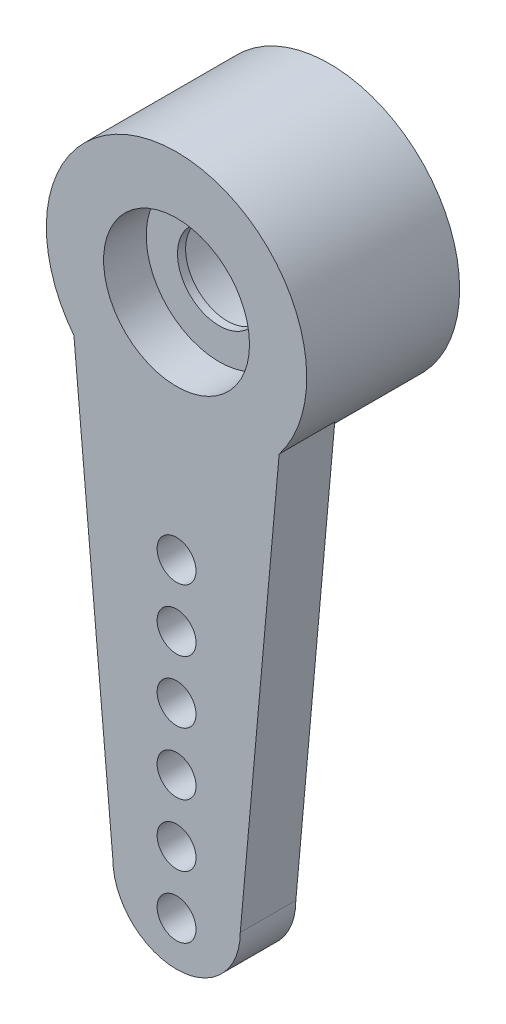
ISO-10303-21;
HEADER;
FILE_DESCRIPTION(('STEP AP214'),'2;1');
FILE_NAME('part.step','',(''),(''),'','','');
FILE_SCHEMA(('AUTOMOTIVE_DESIGN { 1 0 10303 214 1 1 1 1 }'));
ENDSEC;
DATA;
#1=APPLICATION_CONTEXT('core data for automotive mechanical design processes');
#2=APPLICATION_PROTOCOL_DEFINITION('international standard','automotive_design',2000,#1);
#3=PRODUCT_CONTEXT('',#1,'mechanical');
#4=PRODUCT('Part','Part','',(#3));
#5=PRODUCT_RELATED_PRODUCT_CATEGORY('part','',(#4));
#6=PRODUCT_DEFINITION_FORMATION('','',#4);
#7=PRODUCT_DEFINITION_CONTEXT('part definition',#1,'design');
#8=PRODUCT_DEFINITION('design','',#6,#7);
#9=PRODUCT_DEFINITION_SHAPE('','',#8);
#10=(LENGTH_UNIT() NAMED_UNIT(*) SI_UNIT(.MILLI.,.METRE.));
#11=(NAMED_UNIT(*) PLANE_ANGLE_UNIT() SI_UNIT($,.RADIAN.));
#12=(NAMED_UNIT(*) SI_UNIT($,.STERADIAN.) SOLID_ANGLE_UNIT());
#13=UNCERTAINTY_MEASURE_WITH_UNIT(LENGTH_MEASURE(1.E-05),#10,'distance_accuracy_value','');
#14=(GEOMETRIC_REPRESENTATION_CONTEXT(3) GLOBAL_UNCERTAINTY_ASSIGNED_CONTEXT((#13)) GLOBAL_UNIT_ASSIGNED_CONTEXT((#10,
#11,#12)) REPRESENTATION_CONTEXT('',''));
#15=CARTESIAN_POINT('',(0.,0.,0.));
#16=DIRECTION('',(0.,0.,1.));
#17=DIRECTION('',(1.,0.,0.));
#18=AXIS2_PLACEMENT_3D('',#15,#16,#17);
#19=CARTESIAN_POINT('',(-5.49999999999997,0.,-2.84196586235089));
#20=DIRECTION('',(0.,0.,-1.));
#21=DIRECTION('',(-1.,0.,0.));
#22=AXIS2_PLACEMENT_3D('',#19,#20,#21);
#23=CYLINDRICAL_SURFACE('',#22,2.);
#24=CARTESIAN_POINT('',(-5.49999999999997,0.,-7.03296586235089));
#25=DIRECTION('',(0.,0.,1.));
#26=DIRECTION('',(1.,0.,0.));
#27=AXIS2_PLACEMENT_3D('',#24,#25,#26);
#28=CIRCLE('',#27,2.);
#29=CARTESIAN_POINT('',(-3.49999999999996,0.,-7.03296586235089));
#30=VERTEX_POINT('',#29);
#31=EDGE_CURVE('E118',#30,#30,#28,.T.);
#32=ORIENTED_EDGE('',*,*,#31,.F.);
#33=EDGE_LOOP('',(#32));
#34=FACE_BOUND('',#33,.T.);
#35=CARTESIAN_POINT('',(-5.49999999999997,0.,-4.23296586235089));
#36=DIRECTION('',(0.,0.,1.));
#37=DIRECTION('',(1.,0.,0.));
#38=AXIS2_PLACEMENT_3D('',#35,#36,#37);
#39=CIRCLE('',#38,2.00000000000001);
#40=CARTESIAN_POINT('',(-3.49999999999996,0.,-4.23296586235089));
#41=VERTEX_POINT('',#40);
#42=EDGE_CURVE('E114',#41,#41,#39,.T.);
#43=ORIENTED_EDGE('',*,*,#42,.T.);
#44=EDGE_LOOP('',(#43));
#45=FACE_BOUND('',#44,.T.);
#46=ADVANCED_FACE('F41',(#34,#45),#23,.F.);
#47=CARTESIAN_POINT('',(-5.49999999999997,0.,-2.84196586235089));
#48=DIRECTION('',(0.,0.,1.));
#49=DIRECTION('',(1.,0.,0.));
#50=AXIS2_PLACEMENT_3D('',#47,#48,#49);
#51=PLANE('',#50);
#52=CARTESIAN_POINT('',(-5.49999999999997,0.,-2.84196586235089));
#53=DIRECTION('',(0.,0.,1.));
#54=DIRECTION('',(1.,0.,0.));
#55=AXIS2_PLACEMENT_3D('',#52,#53,#54);
#56=CIRCLE('',#55,3.5687);
#57=CARTESIAN_POINT('',(-2.68694999999995,-2.19598938692788,-2.84196586235089));
#58=VERTEX_POINT('',#57);
#59=CARTESIAN_POINT('',(-8.31304999999995,-2.1959893869279,-2.84196586235089));
#60=VERTEX_POINT('',#59);
#61=EDGE_CURVE('E49',#58,#60,#56,.T.);
#62=ORIENTED_EDGE('',*,*,#61,.T.);
#63=DIRECTION('',(0.0893287482023586,-0.996002196154506,0.));
#64=VECTOR('',#63,1.);
#65=CARTESIAN_POINT('',(-7.24624999999995,-14.09065,-2.84196586235089));
#66=LINE('',#65,#64);
#67=CARTESIAN_POINT('',(-7.24624999999995,-14.09065,-2.84196586235089));
#68=VERTEX_POINT('',#67);
#69=EDGE_CURVE('E202',#60,#68,#66,.T.);
#70=ORIENTED_EDGE('',*,*,#69,.T.);
#71=CARTESIAN_POINT('',(-5.49999999999995,-14.09065,-2.84196586235089));
#72=DIRECTION('',(0.,0.,1.));
#73=DIRECTION('',(1.,0.,0.));
#74=AXIS2_PLACEMENT_3D('',#71,#72,#73);
#75=CIRCLE('',#74,1.74625);
#76=CARTESIAN_POINT('',(-3.75374999999995,-14.09065,-2.84196586235089));
#77=VERTEX_POINT('',#76);
#78=EDGE_CURVE('E196',#68,#77,#75,.T.);
#79=ORIENTED_EDGE('',*,*,#78,.T.);
#80=DIRECTION('',(0.0893287482023584,0.996002196154506,0.));
#81=VECTOR('',#80,1.);
#82=CARTESIAN_POINT('',(-3.75374999999995,-14.09065,-2.84196586235089));
#83=LINE('',#82,#81);
#84=EDGE_CURVE('E56',#77,#58,#83,.T.);
#85=ORIENTED_EDGE('',*,*,#84,.T.);
#86=EDGE_LOOP('',(#62,#70,#79,#85));
#87=FACE_BOUND('',#86,.T.);
#88=CARTESIAN_POINT('',(-5.49999999999997,0.,-2.84196586235089));
#89=DIRECTION('',(0.,0.,1.));
#90=DIRECTION('',(1.,0.,0.));
#91=AXIS2_PLACEMENT_3D('',#88,#89,#90);
#92=CIRCLE('',#91,2.);
#93=CARTESIAN_POINT('',(-3.49999999999996,0.,-2.84196586235089));
#94=VERTEX_POINT('',#93);
#95=EDGE_CURVE('E121',#94,#94,#92,.T.);
#96=ORIENTED_EDGE('',*,*,#95,.F.);
#97=EDGE_LOOP('',(#96));
#98=FACE_BOUND('',#97,.T.);
#99=CARTESIAN_POINT('',(-5.49999999999997,-6.11505,-2.84196586235089));
#100=DIRECTION('',(0.,0.,1.));
#101=DIRECTION('',(1.,0.,0.));
#102=AXIS2_PLACEMENT_3D('',#99,#100,#101);
#103=CIRCLE('',#102,0.533399999999999);
#104=CARTESIAN_POINT('',(-4.96659999999997,-6.11505,-2.84196586235089));
#105=VERTEX_POINT('',#104);
#106=EDGE_CURVE('E171',#105,#105,#103,.T.);
#107=ORIENTED_EDGE('',*,*,#106,.F.);
#108=EDGE_LOOP('',(#107));
#109=FACE_BOUND('',#108,.T.);
#110=CARTESIAN_POINT('',(-5.49999999999997,-7.81685,-2.84196586235089));
#111=DIRECTION('',(0.,0.,1.));
#112=DIRECTION('',(1.,0.,0.));
#113=AXIS2_PLACEMENT_3D('',#110,#111,#112);
#114=CIRCLE('',#113,0.533399999999999);
#115=CARTESIAN_POINT('',(-4.96659999999997,-7.81685,-2.84196586235089));
#116=VERTEX_POINT('',#115);
#117=EDGE_CURVE('E175',#116,#116,#114,.T.);
#118=ORIENTED_EDGE('',*,*,#117,.F.);
#119=EDGE_LOOP('',(#118));
#120=FACE_BOUND('',#119,.T.);
#121=CARTESIAN_POINT('',(-5.49999999999997,-9.51865,-2.84196586235089));
#122=DIRECTION('',(0.,0.,1.));
#123=DIRECTION('',(1.,0.,0.));
#124=AXIS2_PLACEMENT_3D('',#121,#122,#123);
#125=CIRCLE('',#124,0.5334);
#126=CARTESIAN_POINT('',(-4.96659999999997,-9.51865,-2.84196586235089));
#127=VERTEX_POINT('',#126);
#128=EDGE_CURVE('E179',#127,#127,#125,.T.);
#129=ORIENTED_EDGE('',*,*,#128,.F.);
#130=EDGE_LOOP('',(#129));
#131=FACE_BOUND('',#130,.T.);
#132=CARTESIAN_POINT('',(-5.49999999999997,-11.22045,-2.84196586235089));
#133=DIRECTION('',(0.,0.,1.));
#134=DIRECTION('',(1.,0.,0.));
#135=AXIS2_PLACEMENT_3D('',#132,#133,#134);
#136=CIRCLE('',#135,0.5334);
#137=CARTESIAN_POINT('',(-4.96659999999997,-11.22045,-2.84196586235089));
#138=VERTEX_POINT('',#137);
#139=EDGE_CURVE('E183',#138,#138,#136,.T.);
#140=ORIENTED_EDGE('',*,*,#139,.F.);
#141=EDGE_LOOP('',(#140));
#142=FACE_BOUND('',#141,.T.);
#143=CARTESIAN_POINT('',(-5.49999999999997,-12.92225,-2.84196586235089));
#144=DIRECTION('',(0.,0.,1.));
#145=DIRECTION('',(1.,0.,0.));
#146=AXIS2_PLACEMENT_3D('',#143,#144,#145);
#147=CIRCLE('',#146,0.5334);
#148=CARTESIAN_POINT('',(-4.96659999999997,-12.92225,-2.84196586235089));
#149=VERTEX_POINT('',#148);
#150=EDGE_CURVE('E187',#149,#149,#147,.T.);
#151=ORIENTED_EDGE('',*,*,#150,.F.);
#152=EDGE_LOOP('',(#151));
#153=FACE_BOUND('',#152,.T.);
#154=CARTESIAN_POINT('',(-5.49999999999995,-14.62405,-2.84196586235089));
#155=DIRECTION('',(0.,0.,1.));
#156=DIRECTION('',(1.,0.,0.));
#157=AXIS2_PLACEMENT_3D('',#154,#155,#156);
#158=CIRCLE('',#157,0.5334);
#159=CARTESIAN_POINT('',(-4.96659999999995,-14.62405,-2.84196586235089));
#160=VERTEX_POINT('',#159);
#161=EDGE_CURVE('E190',#160,#160,#158,.T.);
#162=ORIENTED_EDGE('',*,*,#161,.F.);
#163=EDGE_LOOP('',(#162));
#164=FACE_BOUND('',#163,.T.);
#165=ADVANCED_FACE('F133',(#87,#98,#109,#120,#131,#142,#153,#164),#51,.T.);
#166=CARTESIAN_POINT('',(-5.49999999999997,0.,-7.03296586235089));
#167=DIRECTION('',(0.,0.,1.));
#168=DIRECTION('',(1.,0.,0.));
#169=AXIS2_PLACEMENT_3D('',#166,#167,#168);
#170=PLANE('',#169);
#171=CARTESIAN_POINT('',(-5.49999999999997,0.,-7.03296586235089));
#172=DIRECTION('',(0.,0.,1.));
#173=DIRECTION('',(1.,0.,0.));
#174=AXIS2_PLACEMENT_3D('',#171,#172,#173);
#175=CIRCLE('',#174,3.5687);
#176=CARTESIAN_POINT('',(-1.93129999999997,0.,-7.03296586235089));
#177=VERTEX_POINT('',#176);
#178=EDGE_CURVE('E124',#177,#177,#175,.T.);
#179=ORIENTED_EDGE('',*,*,#178,.F.);
#180=EDGE_LOOP('',(#179));
#181=FACE_BOUND('',#180,.T.);
#182=ORIENTED_EDGE('',*,*,#31,.T.);
#183=EDGE_LOOP('',(#182));
#184=FACE_BOUND('',#183,.T.);
#185=ADVANCED_FACE('F130',(#181,#184),#170,.F.);
#186=CARTESIAN_POINT('',(-5.49999999999997,0.,-2.84196586235089));
#187=DIRECTION('',(0.,0.,-1.));
#188=DIRECTION('',(-1.,0.,0.));
#189=AXIS2_PLACEMENT_3D('',#186,#187,#188);
#190=CYLINDRICAL_SURFACE('',#189,3.5687);
#191=CARTESIAN_POINT('',(-5.49999999999995,0.,-4.36596586235089));
#192=DIRECTION('',(0.,0.,-1.));
#193=DIRECTION('',(-1.,0.,0.));
#194=AXIS2_PLACEMENT_3D('',#191,#192,#193);
#195=CIRCLE('',#194,3.5687);
#196=CARTESIAN_POINT('',(-2.68694999999995,-2.1959893869279,-4.36596586235089));
#197=VERTEX_POINT('',#196);
#198=CARTESIAN_POINT('',(-8.31304999999995,-2.1959893869279,-4.36596586235089));
#199=VERTEX_POINT('',#198);
#200=EDGE_CURVE('E91',#197,#199,#195,.T.);
#201=ORIENTED_EDGE('',*,*,#200,.T.);
#202=DIRECTION('',(0.,0.,1.));
#203=VECTOR('',#202,1.);
#204=CARTESIAN_POINT('',(-8.31304999999995,-2.1959893869279,-4.36596586235089));
#205=LINE('',#204,#203);
#206=EDGE_CURVE('E105',#199,#60,#205,.T.);
#207=ORIENTED_EDGE('',*,*,#206,.T.);
#208=ORIENTED_EDGE('',*,*,#61,.F.);
#209=DIRECTION('',(0.,0.,1.));
#210=VECTOR('',#209,1.);
#211=CARTESIAN_POINT('',(-2.68694999999995,-2.1959893869279,-4.36596586235089));
#212=LINE('',#211,#210);
#213=EDGE_CURVE('E100',#197,#58,#212,.T.);
#214=ORIENTED_EDGE('',*,*,#213,.F.);
#215=EDGE_LOOP('',(#201,#207,#208,#214));
#216=FACE_BOUND('',#215,.T.);
#217=ORIENTED_EDGE('',*,*,#178,.T.);
#218=EDGE_LOOP('',(#217));
#219=FACE_BOUND('',#218,.T.);
#220=ADVANCED_FACE('F43',(#216,#219),#190,.T.);
#221=CARTESIAN_POINT('',(-5.49999999999997,0.,-4.01036586235089));
#222=DIRECTION('',(0.,0.,1.));
#223=DIRECTION('',(1.,0.,0.));
#224=AXIS2_PLACEMENT_3D('',#221,#222,#223);
#225=CIRCLE('',#224,2.);
#226=CARTESIAN_POINT('',(-3.49999999999996,0.,-4.01036586235089));
#227=VERTEX_POINT('',#226);
#228=EDGE_CURVE('E12',#227,#227,#225,.T.);
#229=ORIENTED_EDGE('',*,*,#228,.F.);
#230=EDGE_LOOP('',(#229));
#231=FACE_BOUND('',#230,.T.);
#232=ORIENTED_EDGE('',*,*,#95,.T.);
#233=EDGE_LOOP('',(#232));
#234=FACE_BOUND('',#233,.T.);
#235=ADVANCED_FACE('F139',(#231,#234),#23,.F.);
#236=CARTESIAN_POINT('',(-5.49999999999997,0.,-4.23296586235089));
#237=DIRECTION('',(0.,0.,1.));
#238=DIRECTION('',(1.,0.,0.));
#239=AXIS2_PLACEMENT_3D('',#236,#237,#238);
#240=PLANE('',#239);
#241=ORIENTED_EDGE('',*,*,#42,.F.);
#242=EDGE_LOOP('',(#241));
#243=FACE_BOUND('',#242,.T.);
#244=CARTESIAN_POINT('',(-5.49999999999997,0.,-4.23296586235089));
#245=DIRECTION('',(0.,0.,1.));
#246=DIRECTION('',(1.,0.,0.));
#247=AXIS2_PLACEMENT_3D('',#244,#245,#246);
#248=CIRCLE('',#247,1.14300000000001);
#249=CARTESIAN_POINT('',(-4.35699999999996,0.,-4.23296586235089));
#250=VERTEX_POINT('',#249);
#251=EDGE_CURVE('E111',#250,#250,#248,.T.);
#252=ORIENTED_EDGE('',*,*,#251,.T.);
#253=EDGE_LOOP('',(#252));
#254=FACE_BOUND('',#253,.T.);
#255=ADVANCED_FACE('F142',(#243,#254),#240,.F.);
#256=CARTESIAN_POINT('',(-5.49999999999997,0.,2.81488838714151));
#257=DIRECTION('',(0.,0.,-1.));
#258=DIRECTION('',(-1.,0.,0.));
#259=AXIS2_PLACEMENT_3D('',#256,#257,#258);
#260=CYLINDRICAL_SURFACE('',#259,1.14300000000001);
#261=ORIENTED_EDGE('',*,*,#251,.F.);
#262=EDGE_LOOP('',(#261));
#263=FACE_BOUND('',#262,.T.);
#264=CARTESIAN_POINT('',(-5.49999999999997,0.,-4.01036586235089));
#265=DIRECTION('',(0.,0.,1.));
#266=DIRECTION('',(1.,0.,0.));
#267=AXIS2_PLACEMENT_3D('',#264,#265,#266);
#268=CIRCLE('',#267,1.14300000000001);
#269=CARTESIAN_POINT('',(-4.35699999999996,0.,-4.01036586235089));
#270=VERTEX_POINT('',#269);
#271=EDGE_CURVE('E115',#270,#270,#268,.T.);
#272=ORIENTED_EDGE('',*,*,#271,.T.);
#273=EDGE_LOOP('',(#272));
#274=FACE_BOUND('',#273,.T.);
#275=ADVANCED_FACE('F145',(#263,#274),#260,.F.);
#276=CARTESIAN_POINT('',(-5.49999999999997,0.,-4.01036586235089));
#277=DIRECTION('',(0.,0.,1.));
#278=DIRECTION('',(1.,0.,0.));
#279=AXIS2_PLACEMENT_3D('',#276,#277,#278);
#280=PLANE('',#279);
#281=ORIENTED_EDGE('',*,*,#271,.F.);
#282=EDGE_LOOP('',(#281));
#283=FACE_BOUND('',#282,.T.);
#284=ORIENTED_EDGE('',*,*,#228,.T.);
#285=EDGE_LOOP('',(#284));
#286=FACE_BOUND('',#285,.T.);
#287=ADVANCED_FACE('F151',(#283,#286),#280,.T.);
#288=CARTESIAN_POINT('',(-5.49999999999995,-14.09065,-4.36596586235089));
#289=DIRECTION('',(0.,0.,1.));
#290=DIRECTION('',(1.,0.,0.));
#291=AXIS2_PLACEMENT_3D('',#288,#289,#290);
#292=CYLINDRICAL_SURFACE('',#291,1.74625);
#293=ORIENTED_EDGE('',*,*,#78,.F.);
#294=DIRECTION('',(0.,0.,1.));
#295=VECTOR('',#294,1.);
#296=CARTESIAN_POINT('',(-7.24624999999995,-14.09065,-4.36596586235089));
#297=LINE('',#296,#295);
#298=CARTESIAN_POINT('',(-7.24624999999995,-14.09065,-4.36596586235089));
#299=VERTEX_POINT('',#298);
#300=EDGE_CURVE('E65',#299,#68,#297,.T.);
#301=ORIENTED_EDGE('',*,*,#300,.F.);
#302=CARTESIAN_POINT('',(-5.49999999999995,-14.09065,-4.36596586235089));
#303=DIRECTION('',(0.,0.,1.));
#304=DIRECTION('',(1.,0.,0.));
#305=AXIS2_PLACEMENT_3D('',#302,#303,#304);
#306=CIRCLE('',#305,1.74625);
#307=CARTESIAN_POINT('',(-3.75374999999995,-14.09065,-4.36596586235089));
#308=VERTEX_POINT('',#307);
#309=EDGE_CURVE('E102',#299,#308,#306,.T.);
#310=ORIENTED_EDGE('',*,*,#309,.T.);
#311=DIRECTION('',(0.,0.,1.));
#312=VECTOR('',#311,1.);
#313=CARTESIAN_POINT('',(-3.75374999999995,-14.09065,-4.36596586235089));
#314=LINE('',#313,#312);
#315=EDGE_CURVE('E85',#308,#77,#314,.T.);
#316=ORIENTED_EDGE('',*,*,#315,.T.);
#317=EDGE_LOOP('',(#293,#301,#310,#316));
#318=FACE_BOUND('',#317,.T.);
#319=ADVANCED_FACE('F157',(#318),#292,.T.);
#320=CARTESIAN_POINT('',(-7.24624999999995,-14.09065,-4.36596586235089));
#321=DIRECTION('',(-0.996002196154506,-0.0893287482023586,0.));
#322=DIRECTION('',(0.0893287482023586,-0.996002196154506,0.));
#323=AXIS2_PLACEMENT_3D('',#320,#321,#322);
#324=PLANE('',#323);
#325=ORIENTED_EDGE('',*,*,#69,.F.);
#326=ORIENTED_EDGE('',*,*,#206,.F.);
#327=DIRECTION('',(0.0893287482023586,-0.996002196154506,0.));
#328=VECTOR('',#327,1.);
#329=CARTESIAN_POINT('',(-7.24624999999995,-14.09065,-4.36596586235089));
#330=LINE('',#329,#328);
#331=EDGE_CURVE('E94',#199,#299,#330,.T.);
#332=ORIENTED_EDGE('',*,*,#331,.T.);
#333=ORIENTED_EDGE('',*,*,#300,.T.);
#334=EDGE_LOOP('',(#325,#326,#332,#333));
#335=FACE_BOUND('',#334,.T.);
#336=ADVANCED_FACE('F208',(#335),#324,.T.);
#337=CARTESIAN_POINT('',(-3.75374999999995,-14.09065,-4.36596586235089));
#338=DIRECTION('',(0.996002196154506,-0.0893287482023584,0.));
#339=DIRECTION('',(0.0893287482023584,0.996002196154506,0.));
#340=AXIS2_PLACEMENT_3D('',#337,#338,#339);
#341=PLANE('',#340);
#342=ORIENTED_EDGE('',*,*,#84,.F.);
#343=ORIENTED_EDGE('',*,*,#315,.F.);
#344=DIRECTION('',(0.0893287482023584,0.996002196154506,0.));
#345=VECTOR('',#344,1.);
#346=CARTESIAN_POINT('',(-3.75374999999995,-14.09065,-4.36596586235089));
#347=LINE('',#346,#345);
#348=EDGE_CURVE('E93',#308,#197,#347,.T.);
#349=ORIENTED_EDGE('',*,*,#348,.T.);
#350=ORIENTED_EDGE('',*,*,#213,.T.);
#351=EDGE_LOOP('',(#342,#343,#349,#350));
#352=FACE_BOUND('',#351,.T.);
#353=ADVANCED_FACE('F99',(#352),#341,.T.);
#354=CARTESIAN_POINT('',(-5.49999999999995,-14.09065,-4.36596586235089));
#355=DIRECTION('',(0.,0.,1.));
#356=DIRECTION('',(1.,0.,0.));
#357=AXIS2_PLACEMENT_3D('',#354,#355,#356);
#358=PLANE('',#357);
#359=CARTESIAN_POINT('',(-5.49999999999997,-6.11505,-4.36596586235089));
#360=DIRECTION('',(0.,0.,1.));
#361=DIRECTION('',(1.,0.,0.));
#362=AXIS2_PLACEMENT_3D('',#359,#360,#361);
#363=CIRCLE('',#362,0.533399999999999);
#364=CARTESIAN_POINT('',(-4.96659999999997,-6.11505,-4.36596586235089));
#365=VERTEX_POINT('',#364);
#366=EDGE_CURVE('E249',#365,#365,#363,.T.);
#367=ORIENTED_EDGE('',*,*,#366,.T.);
#368=EDGE_LOOP('',(#367));
#369=FACE_BOUND('',#368,.T.);
#370=CARTESIAN_POINT('',(-5.49999999999997,-7.81685,-4.36596586235089));
#371=DIRECTION('',(0.,0.,1.));
#372=DIRECTION('',(1.,0.,0.));
#373=AXIS2_PLACEMENT_3D('',#370,#371,#372);
#374=CIRCLE('',#373,0.533399999999999);
#375=CARTESIAN_POINT('',(-4.96659999999997,-7.81685,-4.36596586235089));
#376=VERTEX_POINT('',#375);
#377=EDGE_CURVE('E253',#376,#376,#374,.T.);
#378=ORIENTED_EDGE('',*,*,#377,.T.);
#379=EDGE_LOOP('',(#378));
#380=FACE_BOUND('',#379,.T.);
#381=CARTESIAN_POINT('',(-5.49999999999997,-9.51865,-4.36596586235089));
#382=DIRECTION('',(0.,0.,1.));
#383=DIRECTION('',(1.,0.,0.));
#384=AXIS2_PLACEMENT_3D('',#381,#382,#383);
#385=CIRCLE('',#384,0.5334);
#386=CARTESIAN_POINT('',(-4.96659999999997,-9.51865,-4.36596586235089));
#387=VERTEX_POINT('',#386);
#388=EDGE_CURVE('E257',#387,#387,#385,.T.);
#389=ORIENTED_EDGE('',*,*,#388,.T.);
#390=EDGE_LOOP('',(#389));
#391=FACE_BOUND('',#390,.T.);
#392=CARTESIAN_POINT('',(-5.49999999999997,-11.22045,-4.36596586235089));
#393=DIRECTION('',(0.,0.,1.));
#394=DIRECTION('',(1.,0.,0.));
#395=AXIS2_PLACEMENT_3D('',#392,#393,#394);
#396=CIRCLE('',#395,0.5334);
#397=CARTESIAN_POINT('',(-4.96659999999997,-11.22045,-4.36596586235089));
#398=VERTEX_POINT('',#397);
#399=EDGE_CURVE('E261',#398,#398,#396,.T.);
#400=ORIENTED_EDGE('',*,*,#399,.T.);
#401=EDGE_LOOP('',(#400));
#402=FACE_BOUND('',#401,.T.);
#403=CARTESIAN_POINT('',(-5.49999999999997,-12.92225,-4.36596586235089));
#404=DIRECTION('',(0.,0.,1.));
#405=DIRECTION('',(1.,0.,0.));
#406=AXIS2_PLACEMENT_3D('',#403,#404,#405);
#407=CIRCLE('',#406,0.5334);
#408=CARTESIAN_POINT('',(-4.96659999999997,-12.92225,-4.36596586235089));
#409=VERTEX_POINT('',#408);
#410=EDGE_CURVE('E193',#409,#409,#407,.T.);
#411=ORIENTED_EDGE('',*,*,#410,.T.);
#412=EDGE_LOOP('',(#411));
#413=FACE_BOUND('',#412,.T.);
#414=CARTESIAN_POINT('',(-5.49999999999995,-14.62405,-4.36596586235089));
#415=DIRECTION('',(0.,0.,1.));
#416=DIRECTION('',(1.,0.,0.));
#417=AXIS2_PLACEMENT_3D('',#414,#415,#416);
#418=CIRCLE('',#417,0.5334);
#419=CARTESIAN_POINT('',(-4.96659999999995,-14.62405,-4.36596586235089));
#420=VERTEX_POINT('',#419);
#421=EDGE_CURVE('E192',#420,#420,#418,.T.);
#422=ORIENTED_EDGE('',*,*,#421,.T.);
#423=EDGE_LOOP('',(#422));
#424=FACE_BOUND('',#423,.T.);
#425=ORIENTED_EDGE('',*,*,#309,.F.);
#426=ORIENTED_EDGE('',*,*,#331,.F.);
#427=ORIENTED_EDGE('',*,*,#200,.F.);
#428=ORIENTED_EDGE('',*,*,#348,.F.);
#429=EDGE_LOOP('',(#425,#426,#427,#428));
#430=FACE_BOUND('',#429,.T.);
#431=ADVANCED_FACE('F92',(#369,#380,#391,#402,#413,#424,#430),#358,.F.);
#432=CARTESIAN_POINT('',(-5.49999999999995,-14.62405,-4.36596586235089));
#433=DIRECTION('',(0.,0.,1.));
#434=DIRECTION('',(1.,0.,0.));
#435=AXIS2_PLACEMENT_3D('',#432,#433,#434);
#436=CYLINDRICAL_SURFACE('',#435,0.5334);
#437=ORIENTED_EDGE('',*,*,#421,.F.);
#438=EDGE_LOOP('',(#437));
#439=FACE_BOUND('',#438,.T.);
#440=ORIENTED_EDGE('',*,*,#161,.T.);
#441=EDGE_LOOP('',(#440));
#442=FACE_BOUND('',#441,.T.);
#443=ADVANCED_FACE('F220',(#439,#442),#436,.F.);
#444=CARTESIAN_POINT('',(-5.49999999999997,-12.92225,-4.36596586235089));
#445=DIRECTION('',(0.,0.,1.));
#446=DIRECTION('',(1.,0.,0.));
#447=AXIS2_PLACEMENT_3D('',#444,#445,#446);
#448=CYLINDRICAL_SURFACE('',#447,0.5334);
#449=ORIENTED_EDGE('',*,*,#410,.F.);
#450=EDGE_LOOP('',(#449));
#451=FACE_BOUND('',#450,.T.);
#452=ORIENTED_EDGE('',*,*,#150,.T.);
#453=EDGE_LOOP('',(#452));
#454=FACE_BOUND('',#453,.T.);
#455=ADVANCED_FACE('F224',(#451,#454),#448,.F.);
#456=CARTESIAN_POINT('',(-5.49999999999997,-11.22045,-4.36596586235089));
#457=DIRECTION('',(0.,0.,1.));
#458=DIRECTION('',(1.,0.,0.));
#459=AXIS2_PLACEMENT_3D('',#456,#457,#458);
#460=CYLINDRICAL_SURFACE('',#459,0.5334);
#461=ORIENTED_EDGE('',*,*,#399,.F.);
#462=EDGE_LOOP('',(#461));
#463=FACE_BOUND('',#462,.T.);
#464=ORIENTED_EDGE('',*,*,#139,.T.);
#465=EDGE_LOOP('',(#464));
#466=FACE_BOUND('',#465,.T.);
#467=ADVANCED_FACE('F228',(#463,#466),#460,.F.);
#468=CARTESIAN_POINT('',(-5.49999999999997,-9.51865,-4.36596586235089));
#469=DIRECTION('',(0.,0.,1.));
#470=DIRECTION('',(1.,0.,0.));
#471=AXIS2_PLACEMENT_3D('',#468,#469,#470);
#472=CYLINDRICAL_SURFACE('',#471,0.5334);
#473=ORIENTED_EDGE('',*,*,#388,.F.);
#474=EDGE_LOOP('',(#473));
#475=FACE_BOUND('',#474,.T.);
#476=ORIENTED_EDGE('',*,*,#128,.T.);
#477=EDGE_LOOP('',(#476));
#478=FACE_BOUND('',#477,.T.);
#479=ADVANCED_FACE('F232',(#475,#478),#472,.F.);
#480=CARTESIAN_POINT('',(-5.49999999999997,-7.81685,-4.36596586235089));
#481=DIRECTION('',(0.,0.,1.));
#482=DIRECTION('',(1.,0.,0.));
#483=AXIS2_PLACEMENT_3D('',#480,#481,#482);
#484=CYLINDRICAL_SURFACE('',#483,0.533399999999999);
#485=ORIENTED_EDGE('',*,*,#377,.F.);
#486=EDGE_LOOP('',(#485));
#487=FACE_BOUND('',#486,.T.);
#488=ORIENTED_EDGE('',*,*,#117,.T.);
#489=EDGE_LOOP('',(#488));
#490=FACE_BOUND('',#489,.T.);
#491=ADVANCED_FACE('F236',(#487,#490),#484,.F.);
#492=CARTESIAN_POINT('',(-5.49999999999997,-6.11505,-4.36596586235089));
#493=DIRECTION('',(0.,0.,1.));
#494=DIRECTION('',(1.,0.,0.));
#495=AXIS2_PLACEMENT_3D('',#492,#493,#494);
#496=CYLINDRICAL_SURFACE('',#495,0.533399999999999);
#497=ORIENTED_EDGE('',*,*,#366,.F.);
#498=EDGE_LOOP('',(#497));
#499=FACE_BOUND('',#498,.T.);
#500=ORIENTED_EDGE('',*,*,#106,.T.);
#501=EDGE_LOOP('',(#500));
#502=FACE_BOUND('',#501,.T.);
#503=ADVANCED_FACE('F240',(#499,#502),#496,.F.);
#504=CLOSED_SHELL('',(#46,#165,#185,#220,#235,#255,#275,#287,#319,#336,#353,#431,#443,#455,#467,
#479,#491,#503));
#505=MANIFOLD_SOLID_BREP('B2',#504);
#506=ADVANCED_BREP_SHAPE_REPRESENTATION('',(#18,#505),#14);
#507=SHAPE_DEFINITION_REPRESENTATION(#9,#506);
ENDSEC;
END-ISO-10303-21;
